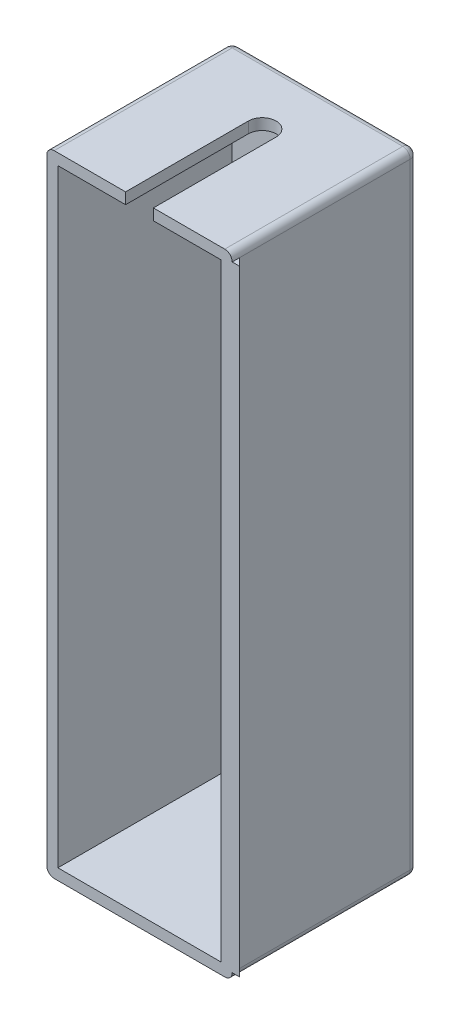
ISO-10303-21;
HEADER;
FILE_DESCRIPTION(('STEP AP214'),'2;1');
FILE_NAME('part.step','',(''),(''),'','','');
FILE_SCHEMA(('AUTOMOTIVE_DESIGN { 1 0 10303 214 1 1 1 1 }'));
ENDSEC;
DATA;
#1=APPLICATION_CONTEXT('core data for automotive mechanical design processes');
#2=APPLICATION_PROTOCOL_DEFINITION('international standard','automotive_design',2000,#1);
#3=PRODUCT_CONTEXT('',#1,'mechanical');
#4=PRODUCT('Part','Part','',(#3));
#5=PRODUCT_RELATED_PRODUCT_CATEGORY('part','',(#4));
#6=PRODUCT_DEFINITION_FORMATION('','',#4);
#7=PRODUCT_DEFINITION_CONTEXT('part definition',#1,'design');
#8=PRODUCT_DEFINITION('design','',#6,#7);
#9=PRODUCT_DEFINITION_SHAPE('','',#8);
#10=(LENGTH_UNIT() NAMED_UNIT(*) SI_UNIT(.MILLI.,.METRE.));
#11=(NAMED_UNIT(*) PLANE_ANGLE_UNIT() SI_UNIT($,.RADIAN.));
#12=(NAMED_UNIT(*) SI_UNIT($,.STERADIAN.) SOLID_ANGLE_UNIT());
#13=UNCERTAINTY_MEASURE_WITH_UNIT(LENGTH_MEASURE(1.E-05),#10,'distance_accuracy_value','');
#14=(GEOMETRIC_REPRESENTATION_CONTEXT(3) GLOBAL_UNCERTAINTY_ASSIGNED_CONTEXT((#13)) GLOBAL_UNIT_ASSIGNED_CONTEXT((#10,
#11,#12)) REPRESENTATION_CONTEXT('',''));
#15=CARTESIAN_POINT('',(0.,0.,0.));
#16=DIRECTION('',(0.,0.,1.));
#17=DIRECTION('',(1.,0.,0.));
#18=AXIS2_PLACEMENT_3D('',#15,#16,#17);
#19=CARTESIAN_POINT('',(25.,85.,50.));
#20=DIRECTION('',(-1.,0.,0.));
#21=DIRECTION('',(0.,-1.,0.));
#22=AXIS2_PLACEMENT_3D('',#19,#20,#21);
#23=PLANE('',#22);
#24=DIRECTION('',(0.,1.,0.));
#25=VECTOR('',#24,1.);
#26=CARTESIAN_POINT('',(25.,83.,48.));
#27=LINE('',#26,#25);
#28=CARTESIAN_POINT('',(25.,-83.,48.));
#29=VERTEX_POINT('',#28);
#30=CARTESIAN_POINT('',(25.,83.,48.));
#31=VERTEX_POINT('',#30);
#32=EDGE_CURVE('E211',#29,#31,#27,.T.);
#33=ORIENTED_EDGE('',*,*,#32,.F.);
#34=DIRECTION('',(0.,0.,-1.));
#35=VECTOR('',#34,1.);
#36=CARTESIAN_POINT('',(25.,-83.,50.));
#37=LINE('',#36,#35);
#38=CARTESIAN_POINT('',(25.,-83.,2.));
#39=VERTEX_POINT('',#38);
#40=EDGE_CURVE('E274',#29,#39,#37,.T.);
#41=ORIENTED_EDGE('',*,*,#40,.T.);
#42=DIRECTION('',(0.,1.,0.));
#43=VECTOR('',#42,1.);
#44=CARTESIAN_POINT('',(25.,85.,2.));
#45=LINE('',#44,#43);
#46=CARTESIAN_POINT('',(25.,83.,2.));
#47=VERTEX_POINT('',#46);
#48=EDGE_CURVE('E272',#39,#47,#45,.T.);
#49=ORIENTED_EDGE('',*,*,#48,.T.);
#50=DIRECTION('',(0.,0.,-1.));
#51=VECTOR('',#50,1.);
#52=CARTESIAN_POINT('',(25.,83.,50.));
#53=LINE('',#52,#51);
#54=EDGE_CURVE('E269',#47,#31,#53,.F.);
#55=ORIENTED_EDGE('',*,*,#54,.T.);
#56=EDGE_LOOP('',(#33,#41,#49,#55));
#57=FACE_BOUND('',#56,.T.);
#58=ADVANCED_FACE('F41',(#57),#23,.F.);
#59=CARTESIAN_POINT('',(-25.,85.,50.));
#60=DIRECTION('',(1.,0.,0.));
#61=DIRECTION('',(0.,1.,0.));
#62=AXIS2_PLACEMENT_3D('',#59,#60,#61);
#63=PLANE('',#62);
#64=DIRECTION('',(0.,-1.,0.));
#65=VECTOR('',#64,1.);
#66=CARTESIAN_POINT('',(-25.,-85.,2.));
#67=LINE('',#66,#65);
#68=CARTESIAN_POINT('',(-25.,83.,2.));
#69=VERTEX_POINT('',#68);
#70=CARTESIAN_POINT('',(-25.,-83.,2.));
#71=VERTEX_POINT('',#70);
#72=EDGE_CURVE('E303',#69,#71,#67,.T.);
#73=ORIENTED_EDGE('',*,*,#72,.T.);
#74=DIRECTION('',(0.,0.,-1.));
#75=VECTOR('',#74,1.);
#76=CARTESIAN_POINT('',(-25.,-83.,50.));
#77=LINE('',#76,#75);
#78=CARTESIAN_POINT('',(-25.,-83.,50.));
#79=VERTEX_POINT('',#78);
#80=EDGE_CURVE('E305',#71,#79,#77,.F.);
#81=ORIENTED_EDGE('',*,*,#80,.T.);
#82=DIRECTION('',(0.,-1.,0.));
#83=VECTOR('',#82,1.);
#84=CARTESIAN_POINT('',(-25.,85.,50.));
#85=LINE('',#84,#83);
#86=CARTESIAN_POINT('',(-25.,83.,50.));
#87=VERTEX_POINT('',#86);
#88=EDGE_CURVE('E254',#87,#79,#85,.T.);
#89=ORIENTED_EDGE('',*,*,#88,.F.);
#90=DIRECTION('',(0.,0.,-1.));
#91=VECTOR('',#90,1.);
#92=CARTESIAN_POINT('',(-25.,83.,50.));
#93=LINE('',#92,#91);
#94=EDGE_CURVE('E301',#87,#69,#93,.T.);
#95=ORIENTED_EDGE('',*,*,#94,.T.);
#96=EDGE_LOOP('',(#73,#81,#89,#95));
#97=FACE_BOUND('',#96,.T.);
#98=ADVANCED_FACE('F410',(#97),#63,.F.);
#99=CARTESIAN_POINT('',(25.,-85.,50.));
#100=DIRECTION('',(0.,1.,0.));
#101=DIRECTION('',(0.,0.,1.));
#102=AXIS2_PLACEMENT_3D('',#99,#100,#101);
#103=PLANE('',#102);
#104=DIRECTION('',(1.,0.,0.));
#105=VECTOR('',#104,1.);
#106=CARTESIAN_POINT('',(25.,-85.,2.));
#107=LINE('',#106,#105);
#108=CARTESIAN_POINT('',(-23.,-85.,2.));
#109=VERTEX_POINT('',#108);
#110=CARTESIAN_POINT('',(23.,-85.,2.));
#111=VERTEX_POINT('',#110);
#112=EDGE_CURVE('E280',#109,#111,#107,.T.);
#113=ORIENTED_EDGE('',*,*,#112,.T.);
#114=DIRECTION('',(0.,0.,-1.));
#115=VECTOR('',#114,1.);
#116=CARTESIAN_POINT('',(23.,-85.,50.));
#117=LINE('',#116,#115);
#118=CARTESIAN_POINT('',(23.,-85.,50.));
#119=VERTEX_POINT('',#118);
#120=EDGE_CURVE('E282',#111,#119,#117,.F.);
#121=ORIENTED_EDGE('',*,*,#120,.T.);
#122=DIRECTION('',(1.,0.,0.));
#123=VECTOR('',#122,1.);
#124=CARTESIAN_POINT('',(25.,-85.,50.));
#125=LINE('',#124,#123);
#126=CARTESIAN_POINT('',(-23.,-85.,50.));
#127=VERTEX_POINT('',#126);
#128=EDGE_CURVE('E263',#127,#119,#125,.T.);
#129=ORIENTED_EDGE('',*,*,#128,.F.);
#130=DIRECTION('',(0.,0.,-1.));
#131=VECTOR('',#130,1.);
#132=CARTESIAN_POINT('',(-23.,-85.,50.));
#133=LINE('',#132,#131);
#134=EDGE_CURVE('E278',#127,#109,#133,.T.);
#135=ORIENTED_EDGE('',*,*,#134,.T.);
#136=EDGE_LOOP('',(#113,#121,#129,#135));
#137=FACE_BOUND('',#136,.T.);
#138=ADVANCED_FACE('F420',(#137),#103,.F.);
#139=CARTESIAN_POINT('',(25.,85.,50.));
#140=DIRECTION('',(0.,-1.,0.));
#141=DIRECTION('',(0.,0.,-1.));
#142=AXIS2_PLACEMENT_3D('',#139,#140,#141);
#143=PLANE('',#142);
#144=CARTESIAN_POINT('',(0.,85.,16.8957688841481));
#145=DIRECTION('',(0.,1.,0.));
#146=DIRECTION('',(0.,0.,1.));
#147=AXIS2_PLACEMENT_3D('',#144,#145,#146);
#148=CIRCLE('',#147,3.75027902119465);
#149=CARTESIAN_POINT('',(3.75027902119465,85.,16.8957688841481));
#150=VERTEX_POINT('',#149);
#151=CARTESIAN_POINT('',(-3.75027902119465,85.,16.8957688841481));
#152=VERTEX_POINT('',#151);
#153=EDGE_CURVE('E188',#150,#152,#148,.T.);
#154=ORIENTED_EDGE('',*,*,#153,.F.);
#155=DIRECTION('',(0.,0.,-1.));
#156=VECTOR('',#155,1.);
#157=CARTESIAN_POINT('',(3.75027902119465,85.,16.8957688841481));
#158=LINE('',#157,#156);
#159=CARTESIAN_POINT('',(3.75027902119463,85.,50.));
#160=VERTEX_POINT('',#159);
#161=EDGE_CURVE('E185',#160,#150,#158,.T.);
#162=ORIENTED_EDGE('',*,*,#161,.F.);
#163=DIRECTION('',(-1.,0.,0.));
#164=VECTOR('',#163,1.);
#165=CARTESIAN_POINT('',(25.,85.,50.));
#166=LINE('',#165,#164);
#167=CARTESIAN_POINT('',(23.,85.,50.));
#168=VERTEX_POINT('',#167);
#169=EDGE_CURVE('E266',#168,#160,#166,.T.);
#170=ORIENTED_EDGE('',*,*,#169,.F.);
#171=DIRECTION('',(0.,0.,-1.));
#172=VECTOR('',#171,1.);
#173=CARTESIAN_POINT('',(23.,85.,50.));
#174=LINE('',#173,#172);
#175=CARTESIAN_POINT('',(23.,85.,2.));
#176=VERTEX_POINT('',#175);
#177=EDGE_CURVE('E64',#168,#176,#174,.T.);
#178=ORIENTED_EDGE('',*,*,#177,.T.);
#179=DIRECTION('',(-1.,0.,0.));
#180=VECTOR('',#179,1.);
#181=CARTESIAN_POINT('',(-25.,85.,2.));
#182=LINE('',#181,#180);
#183=CARTESIAN_POINT('',(-23.,85.,2.));
#184=VERTEX_POINT('',#183);
#185=EDGE_CURVE('E309',#176,#184,#182,.T.);
#186=ORIENTED_EDGE('',*,*,#185,.T.);
#187=DIRECTION('',(0.,0.,-1.));
#188=VECTOR('',#187,1.);
#189=CARTESIAN_POINT('',(-23.,85.,50.));
#190=LINE('',#189,#188);
#191=CARTESIAN_POINT('',(-23.,85.,50.));
#192=VERTEX_POINT('',#191);
#193=EDGE_CURVE('E307',#184,#192,#190,.F.);
#194=ORIENTED_EDGE('',*,*,#193,.T.);
#195=CARTESIAN_POINT('',(-3.75027902119467,85.,50.));
#196=VERTEX_POINT('',#195);
#197=EDGE_CURVE('E198',#196,#192,#166,.T.);
#198=ORIENTED_EDGE('',*,*,#197,.F.);
#199=DIRECTION('',(0.,0.,1.));
#200=VECTOR('',#199,1.);
#201=CARTESIAN_POINT('',(-3.75027902119465,85.,16.8957688841481));
#202=LINE('',#201,#200);
#203=EDGE_CURVE('E181',#152,#196,#202,.T.);
#204=ORIENTED_EDGE('',*,*,#203,.F.);
#205=EDGE_LOOP('',(#154,#162,#170,#178,#186,#194,#198,#204));
#206=FACE_BOUND('',#205,.T.);
#207=ADVANCED_FACE('F196',(#206),#143,.F.);
#208=CARTESIAN_POINT('',(0.,0.,50.));
#209=DIRECTION('',(0.,0.,-1.));
#210=DIRECTION('',(-1.,0.,0.));
#211=AXIS2_PLACEMENT_3D('',#208,#209,#210);
#212=PLANE('',#211);
#213=ORIENTED_EDGE('',*,*,#169,.T.);
#214=DIRECTION('',(0.,1.,0.));
#215=VECTOR('',#214,1.);
#216=CARTESIAN_POINT('',(3.75027902119463,75.,50.));
#217=LINE('',#216,#215);
#218=CARTESIAN_POINT('',(3.75027902119463,82.,50.));
#219=VERTEX_POINT('',#218);
#220=EDGE_CURVE('E204',#219,#160,#217,.T.);
#221=ORIENTED_EDGE('',*,*,#220,.F.);
#222=DIRECTION('',(-1.,0.,0.));
#223=VECTOR('',#222,1.);
#224=CARTESIAN_POINT('',(-22.,82.,50.));
#225=LINE('',#224,#223);
#226=CARTESIAN_POINT('',(22.,82.,50.));
#227=VERTEX_POINT('',#226);
#228=EDGE_CURVE('E229',#227,#219,#225,.T.);
#229=ORIENTED_EDGE('',*,*,#228,.F.);
#230=DIRECTION('',(0.,1.,0.));
#231=VECTOR('',#230,1.);
#232=CARTESIAN_POINT('',(22.,82.,50.));
#233=LINE('',#232,#231);
#234=CARTESIAN_POINT('',(22.,-82.,50.));
#235=VERTEX_POINT('',#234);
#236=EDGE_CURVE('E245',#235,#227,#233,.T.);
#237=ORIENTED_EDGE('',*,*,#236,.F.);
#238=DIRECTION('',(1.,0.,0.));
#239=VECTOR('',#238,1.);
#240=CARTESIAN_POINT('',(-22.,-82.,50.));
#241=LINE('',#240,#239);
#242=CARTESIAN_POINT('',(-22.,-82.,50.));
#243=VERTEX_POINT('',#242);
#244=EDGE_CURVE('E241',#243,#235,#241,.T.);
#245=ORIENTED_EDGE('',*,*,#244,.F.);
#246=DIRECTION('',(0.,-1.,0.));
#247=VECTOR('',#246,1.);
#248=CARTESIAN_POINT('',(-22.,82.,50.));
#249=LINE('',#248,#247);
#250=CARTESIAN_POINT('',(-22.,82.,50.));
#251=VERTEX_POINT('',#250);
#252=EDGE_CURVE('E239',#251,#243,#249,.T.);
#253=ORIENTED_EDGE('',*,*,#252,.F.);
#254=CARTESIAN_POINT('',(-3.75027902119466,82.,50.));
#255=VERTEX_POINT('',#254);
#256=EDGE_CURVE('E248',#255,#251,#225,.T.);
#257=ORIENTED_EDGE('',*,*,#256,.F.);
#258=DIRECTION('',(0.,1.,0.));
#259=VECTOR('',#258,1.);
#260=CARTESIAN_POINT('',(-3.75027902119467,75.,50.));
#261=LINE('',#260,#259);
#262=EDGE_CURVE('E56',#255,#196,#261,.T.);
#263=ORIENTED_EDGE('',*,*,#262,.T.);
#264=ORIENTED_EDGE('',*,*,#197,.T.);
#265=CARTESIAN_POINT('',(-23.,83.,50.));
#266=DIRECTION('',(0.,0.,-1.));
#267=DIRECTION('',(-1.,0.,0.));
#268=AXIS2_PLACEMENT_3D('',#265,#266,#267);
#269=CIRCLE('',#268,2.);
#270=EDGE_CURVE('E284',#192,#87,#269,.F.);
#271=ORIENTED_EDGE('',*,*,#270,.T.);
#272=ORIENTED_EDGE('',*,*,#88,.T.);
#273=CARTESIAN_POINT('',(-23.,-83.,50.));
#274=DIRECTION('',(0.,0.,-1.));
#275=DIRECTION('',(-1.,0.,0.));
#276=AXIS2_PLACEMENT_3D('',#273,#274,#275);
#277=CIRCLE('',#276,2.);
#278=EDGE_CURVE('E288',#79,#127,#277,.F.);
#279=ORIENTED_EDGE('',*,*,#278,.T.);
#280=ORIENTED_EDGE('',*,*,#128,.T.);
#281=CARTESIAN_POINT('',(23.,-83.,50.));
#282=DIRECTION('',(0.,0.,-1.));
#283=DIRECTION('',(-1.,0.,0.));
#284=AXIS2_PLACEMENT_3D('',#281,#282,#283);
#285=CIRCLE('',#284,2.);
#286=CARTESIAN_POINT('',(25.,-83.,50.));
#287=VERTEX_POINT('',#286);
#288=EDGE_CURVE('E290',#119,#287,#285,.F.);
#289=ORIENTED_EDGE('',*,*,#288,.T.);
#290=DIRECTION('',(-1.,0.,0.));
#291=VECTOR('',#290,1.);
#292=CARTESIAN_POINT('',(27.,-83.,50.));
#293=LINE('',#292,#291);
#294=CARTESIAN_POINT('',(27.,-83.,50.));
#295=VERTEX_POINT('',#294);
#296=EDGE_CURVE('E221',#295,#287,#293,.T.);
#297=ORIENTED_EDGE('',*,*,#296,.F.);
#298=DIRECTION('',(0.,-1.,0.));
#299=VECTOR('',#298,1.);
#300=CARTESIAN_POINT('',(27.,83.,50.));
#301=LINE('',#300,#299);
#302=CARTESIAN_POINT('',(27.,83.,50.));
#303=VERTEX_POINT('',#302);
#304=EDGE_CURVE('E212',#303,#295,#301,.T.);
#305=ORIENTED_EDGE('',*,*,#304,.F.);
#306=DIRECTION('',(-1.,0.,0.));
#307=VECTOR('',#306,1.);
#308=CARTESIAN_POINT('',(27.,83.,50.));
#309=LINE('',#308,#307);
#310=CARTESIAN_POINT('',(25.,83.,50.));
#311=VERTEX_POINT('',#310);
#312=EDGE_CURVE('E214',#303,#311,#309,.T.);
#313=ORIENTED_EDGE('',*,*,#312,.T.);
#314=CARTESIAN_POINT('',(23.,83.,50.));
#315=DIRECTION('',(0.,0.,-1.));
#316=DIRECTION('',(-1.,0.,0.));
#317=AXIS2_PLACEMENT_3D('',#314,#315,#316);
#318=CIRCLE('',#317,2.);
#319=EDGE_CURVE('E286',#311,#168,#318,.F.);
#320=ORIENTED_EDGE('',*,*,#319,.T.);
#321=EDGE_LOOP('',(#213,#221,#229,#237,#245,#253,#257,#263,#264,#271,#272,#279,#280,#289,#297,
#305,#313,#320));
#322=FACE_BOUND('',#321,.T.);
#323=ADVANCED_FACE('F352',(#322),#212,.F.);
#324=CARTESIAN_POINT('',(0.,0.,0.));
#325=DIRECTION('',(0.,0.,-1.));
#326=DIRECTION('',(-1.,0.,0.));
#327=AXIS2_PLACEMENT_3D('',#324,#325,#326);
#328=PLANE('',#327);
#329=DIRECTION('',(-1.,0.,0.));
#330=VECTOR('',#329,1.);
#331=CARTESIAN_POINT('',(25.,83.,0.));
#332=LINE('',#331,#330);
#333=CARTESIAN_POINT('',(-23.,83.,0.));
#334=VERTEX_POINT('',#333);
#335=CARTESIAN_POINT('',(23.,83.,0.));
#336=VERTEX_POINT('',#335);
#337=EDGE_CURVE('E292',#334,#336,#332,.F.);
#338=ORIENTED_EDGE('',*,*,#337,.T.);
#339=DIRECTION('',(0.,1.,0.));
#340=VECTOR('',#339,1.);
#341=CARTESIAN_POINT('',(23.,-85.,0.));
#342=LINE('',#341,#340);
#343=CARTESIAN_POINT('',(23.,-83.,0.));
#344=VERTEX_POINT('',#343);
#345=EDGE_CURVE('E298',#336,#344,#342,.F.);
#346=ORIENTED_EDGE('',*,*,#345,.T.);
#347=DIRECTION('',(1.,0.,0.));
#348=VECTOR('',#347,1.);
#349=CARTESIAN_POINT('',(-25.,-83.,0.));
#350=LINE('',#349,#348);
#351=CARTESIAN_POINT('',(-23.,-83.,0.));
#352=VERTEX_POINT('',#351);
#353=EDGE_CURVE('E296',#344,#352,#350,.F.);
#354=ORIENTED_EDGE('',*,*,#353,.T.);
#355=DIRECTION('',(0.,-1.,0.));
#356=VECTOR('',#355,1.);
#357=CARTESIAN_POINT('',(-23.,85.,0.));
#358=LINE('',#357,#356);
#359=EDGE_CURVE('E294',#352,#334,#358,.F.);
#360=ORIENTED_EDGE('',*,*,#359,.T.);
#361=EDGE_LOOP('',(#338,#346,#354,#360));
#362=FACE_BOUND('',#361,.T.);
#363=ADVANCED_FACE('F425',(#362),#328,.T.);
#364=CARTESIAN_POINT('',(-22.,82.,3.));
#365=DIRECTION('',(-1.,0.,0.));
#366=DIRECTION('',(0.,-1.,0.));
#367=AXIS2_PLACEMENT_3D('',#364,#365,#366);
#368=PLANE('',#367);
#369=ORIENTED_EDGE('',*,*,#252,.T.);
#370=DIRECTION('',(0.,0.,1.));
#371=VECTOR('',#370,1.);
#372=CARTESIAN_POINT('',(-22.,-82.,3.));
#373=LINE('',#372,#371);
#374=CARTESIAN_POINT('',(-22.,-82.,3.));
#375=VERTEX_POINT('',#374);
#376=EDGE_CURVE('E238',#375,#243,#373,.T.);
#377=ORIENTED_EDGE('',*,*,#376,.F.);
#378=DIRECTION('',(0.,-1.,0.));
#379=VECTOR('',#378,1.);
#380=CARTESIAN_POINT('',(-22.,82.,3.));
#381=LINE('',#380,#379);
#382=CARTESIAN_POINT('',(-22.,82.,3.));
#383=VERTEX_POINT('',#382);
#384=EDGE_CURVE('E225',#383,#375,#381,.T.);
#385=ORIENTED_EDGE('',*,*,#384,.F.);
#386=DIRECTION('',(0.,0.,1.));
#387=VECTOR('',#386,1.);
#388=CARTESIAN_POINT('',(-22.,82.,3.));
#389=LINE('',#388,#387);
#390=EDGE_CURVE('E251',#383,#251,#389,.T.);
#391=ORIENTED_EDGE('',*,*,#390,.T.);
#392=EDGE_LOOP('',(#369,#377,#385,#391));
#393=FACE_BOUND('',#392,.T.);
#394=ADVANCED_FACE('F671',(#393),#368,.F.);
#395=CARTESIAN_POINT('',(-22.,82.,3.));
#396=DIRECTION('',(0.,1.,0.));
#397=DIRECTION('',(0.,0.,1.));
#398=AXIS2_PLACEMENT_3D('',#395,#396,#397);
#399=PLANE('',#398);
#400=ORIENTED_EDGE('',*,*,#228,.T.);
#401=DIRECTION('',(0.,0.,-1.));
#402=VECTOR('',#401,1.);
#403=CARTESIAN_POINT('',(3.75027902119466,82.,3.00000000000002));
#404=LINE('',#403,#402);
#405=CARTESIAN_POINT('',(3.75027902119465,82.,16.8957688841481));
#406=VERTEX_POINT('',#405);
#407=EDGE_CURVE('E11',#219,#406,#404,.T.);
#408=ORIENTED_EDGE('',*,*,#407,.T.);
#409=CARTESIAN_POINT('',(0.,82.,16.8957688841481));
#410=DIRECTION('',(0.,1.,0.));
#411=DIRECTION('',(0.,0.,1.));
#412=AXIS2_PLACEMENT_3D('',#409,#410,#411);
#413=CIRCLE('',#412,3.75027902119465);
#414=CARTESIAN_POINT('',(-3.75027902119465,82.,16.8957688841481));
#415=VERTEX_POINT('',#414);
#416=EDGE_CURVE('E49',#406,#415,#413,.T.);
#417=ORIENTED_EDGE('',*,*,#416,.T.);
#418=DIRECTION('',(0.,0.,1.));
#419=VECTOR('',#418,1.);
#420=CARTESIAN_POINT('',(-3.75027902119463,82.,3.00000000000001));
#421=LINE('',#420,#419);
#422=EDGE_CURVE('E182',#415,#255,#421,.T.);
#423=ORIENTED_EDGE('',*,*,#422,.T.);
#424=ORIENTED_EDGE('',*,*,#256,.T.);
#425=ORIENTED_EDGE('',*,*,#390,.F.);
#426=DIRECTION('',(-1.,0.,0.));
#427=VECTOR('',#426,1.);
#428=CARTESIAN_POINT('',(-22.,82.,3.));
#429=LINE('',#428,#427);
#430=CARTESIAN_POINT('',(22.,82.,3.));
#431=VERTEX_POINT('',#430);
#432=EDGE_CURVE('E235',#431,#383,#429,.T.);
#433=ORIENTED_EDGE('',*,*,#432,.F.);
#434=DIRECTION('',(0.,0.,1.));
#435=VECTOR('',#434,1.);
#436=CARTESIAN_POINT('',(22.,82.,3.));
#437=LINE('',#436,#435);
#438=EDGE_CURVE('E255',#431,#227,#437,.T.);
#439=ORIENTED_EDGE('',*,*,#438,.T.);
#440=EDGE_LOOP('',(#400,#408,#417,#423,#424,#425,#433,#439));
#441=FACE_BOUND('',#440,.T.);
#442=ADVANCED_FACE('F346',(#441),#399,.F.);
#443=CARTESIAN_POINT('',(22.,82.,3.));
#444=DIRECTION('',(1.,0.,0.));
#445=DIRECTION('',(0.,1.,0.));
#446=AXIS2_PLACEMENT_3D('',#443,#444,#445);
#447=PLANE('',#446);
#448=ORIENTED_EDGE('',*,*,#236,.T.);
#449=ORIENTED_EDGE('',*,*,#438,.F.);
#450=DIRECTION('',(0.,1.,0.));
#451=VECTOR('',#450,1.);
#452=CARTESIAN_POINT('',(22.,82.,3.));
#453=LINE('',#452,#451);
#454=CARTESIAN_POINT('',(22.,-82.,3.));
#455=VERTEX_POINT('',#454);
#456=EDGE_CURVE('E232',#455,#431,#453,.T.);
#457=ORIENTED_EDGE('',*,*,#456,.F.);
#458=DIRECTION('',(0.,0.,1.));
#459=VECTOR('',#458,1.);
#460=CARTESIAN_POINT('',(22.,-82.,3.));
#461=LINE('',#460,#459);
#462=EDGE_CURVE('E257',#455,#235,#461,.T.);
#463=ORIENTED_EDGE('',*,*,#462,.T.);
#464=EDGE_LOOP('',(#448,#449,#457,#463));
#465=FACE_BOUND('',#464,.T.);
#466=ADVANCED_FACE('F650',(#465),#447,.F.);
#467=CARTESIAN_POINT('',(-22.,-82.,3.));
#468=DIRECTION('',(0.,-1.,0.));
#469=DIRECTION('',(0.,0.,-1.));
#470=AXIS2_PLACEMENT_3D('',#467,#468,#469);
#471=PLANE('',#470);
#472=ORIENTED_EDGE('',*,*,#244,.T.);
#473=ORIENTED_EDGE('',*,*,#462,.F.);
#474=DIRECTION('',(1.,0.,0.));
#475=VECTOR('',#474,1.);
#476=CARTESIAN_POINT('',(-22.,-82.,3.));
#477=LINE('',#476,#475);
#478=EDGE_CURVE('E228',#375,#455,#477,.T.);
#479=ORIENTED_EDGE('',*,*,#478,.F.);
#480=ORIENTED_EDGE('',*,*,#376,.T.);
#481=EDGE_LOOP('',(#472,#473,#479,#480));
#482=FACE_BOUND('',#481,.T.);
#483=ADVANCED_FACE('F638',(#482),#471,.F.);
#484=CARTESIAN_POINT('',(0.,0.,3.));
#485=DIRECTION('',(0.,0.,1.));
#486=DIRECTION('',(1.,0.,0.));
#487=AXIS2_PLACEMENT_3D('',#484,#485,#486);
#488=PLANE('',#487);
#489=ORIENTED_EDGE('',*,*,#384,.T.);
#490=ORIENTED_EDGE('',*,*,#478,.T.);
#491=ORIENTED_EDGE('',*,*,#456,.T.);
#492=ORIENTED_EDGE('',*,*,#432,.T.);
#493=EDGE_LOOP('',(#489,#490,#491,#492));
#494=FACE_BOUND('',#493,.T.);
#495=ADVANCED_FACE('F628',(#494),#488,.T.);
#496=CARTESIAN_POINT('',(-23.,83.,50.));
#497=DIRECTION('',(0.,0.,-1.));
#498=DIRECTION('',(-1.,0.,0.));
#499=AXIS2_PLACEMENT_3D('',#496,#497,#498);
#500=CYLINDRICAL_SURFACE('',#499,2.);
#501=CARTESIAN_POINT('',(-23.,83.,2.));
#502=DIRECTION('',(0.,0.,-1.));
#503=DIRECTION('',(-1.,0.,0.));
#504=AXIS2_PLACEMENT_3D('',#501,#502,#503);
#505=CIRCLE('',#504,2.);
#506=EDGE_CURVE('E242',#69,#184,#505,.T.);
#507=ORIENTED_EDGE('',*,*,#506,.F.);
#508=ORIENTED_EDGE('',*,*,#94,.F.);
#509=ORIENTED_EDGE('',*,*,#270,.F.);
#510=ORIENTED_EDGE('',*,*,#193,.F.);
#511=EDGE_LOOP('',(#507,#508,#509,#510));
#512=FACE_BOUND('',#511,.T.);
#513=ADVANCED_FACE('F43',(#512),#500,.T.);
#514=CARTESIAN_POINT('',(-23.,83.,2.));
#515=DIRECTION('',(0.,1.,0.));
#516=DIRECTION('',(0.,0.,1.));
#517=AXIS2_PLACEMENT_3D('',#514,#515,#516);
#518=SPHERICAL_SURFACE('',#517,2.);
#519=CARTESIAN_POINT('',(-23.,83.,2.));
#520=DIRECTION('',(0.,1.,0.));
#521=DIRECTION('',(0.,0.,1.));
#522=AXIS2_PLACEMENT_3D('',#519,#520,#521);
#523=CIRCLE('',#522,2.);
#524=EDGE_CURVE('E337',#69,#334,#523,.F.);
#525=ORIENTED_EDGE('',*,*,#524,.F.);
#526=ORIENTED_EDGE('',*,*,#506,.T.);
#527=CARTESIAN_POINT('',(-23.,83.,2.));
#528=DIRECTION('',(-1.,0.,0.));
#529=DIRECTION('',(0.,0.,1.));
#530=AXIS2_PLACEMENT_3D('',#527,#528,#529);
#531=CIRCLE('',#530,2.);
#532=EDGE_CURVE('E340',#334,#184,#531,.F.);
#533=ORIENTED_EDGE('',*,*,#532,.F.);
#534=EDGE_LOOP('',(#525,#526,#533));
#535=FACE_BOUND('',#534,.T.);
#536=ADVANCED_FACE('F402',(#535),#518,.T.);
#537=CARTESIAN_POINT('',(23.,83.,50.));
#538=DIRECTION('',(0.,0.,-1.));
#539=DIRECTION('',(-1.,0.,0.));
#540=AXIS2_PLACEMENT_3D('',#537,#538,#539);
#541=CYLINDRICAL_SURFACE('',#540,2.);
#542=ORIENTED_EDGE('',*,*,#319,.F.);
#543=DIRECTION('',(0.,0.,1.));
#544=VECTOR('',#543,1.);
#545=CARTESIAN_POINT('',(25.,83.,50.));
#546=LINE('',#545,#544);
#547=EDGE_CURVE('E215',#31,#311,#546,.T.);
#548=ORIENTED_EDGE('',*,*,#547,.F.);
#549=ORIENTED_EDGE('',*,*,#54,.F.);
#550=CARTESIAN_POINT('',(23.,83.,2.));
#551=DIRECTION('',(0.,0.,-1.));
#552=DIRECTION('',(-1.,0.,0.));
#553=AXIS2_PLACEMENT_3D('',#550,#551,#552);
#554=CIRCLE('',#553,2.);
#555=EDGE_CURVE('E334',#176,#47,#554,.T.);
#556=ORIENTED_EDGE('',*,*,#555,.F.);
#557=ORIENTED_EDGE('',*,*,#177,.F.);
#558=EDGE_LOOP('',(#542,#548,#549,#556,#557));
#559=FACE_BOUND('',#558,.T.);
#560=ADVANCED_FACE('F358',(#559),#541,.T.);
#561=CARTESIAN_POINT('',(25.,83.,2.));
#562=DIRECTION('',(1.,0.,0.));
#563=DIRECTION('',(0.,0.,-1.));
#564=AXIS2_PLACEMENT_3D('',#561,#562,#563);
#565=CYLINDRICAL_SURFACE('',#564,2.);
#566=ORIENTED_EDGE('',*,*,#532,.T.);
#567=ORIENTED_EDGE('',*,*,#185,.F.);
#568=CARTESIAN_POINT('',(23.,83.,2.));
#569=DIRECTION('',(1.,0.,0.));
#570=DIRECTION('',(0.,0.,-1.));
#571=AXIS2_PLACEMENT_3D('',#568,#569,#570);
#572=CIRCLE('',#571,2.);
#573=EDGE_CURVE('E331',#336,#176,#572,.T.);
#574=ORIENTED_EDGE('',*,*,#573,.F.);
#575=ORIENTED_EDGE('',*,*,#337,.F.);
#576=EDGE_LOOP('',(#566,#567,#574,#575));
#577=FACE_BOUND('',#576,.T.);
#578=ADVANCED_FACE('F393',(#577),#565,.T.);
#579=CARTESIAN_POINT('',(-23.,85.,2.));
#580=DIRECTION('',(0.,1.,0.));
#581=DIRECTION('',(-1.,0.,0.));
#582=AXIS2_PLACEMENT_3D('',#579,#580,#581);
#583=CYLINDRICAL_SURFACE('',#582,2.);
#584=ORIENTED_EDGE('',*,*,#524,.T.);
#585=ORIENTED_EDGE('',*,*,#359,.F.);
#586=CARTESIAN_POINT('',(-23.,-83.,2.));
#587=DIRECTION('',(0.,-1.,0.));
#588=DIRECTION('',(0.,0.,-1.));
#589=AXIS2_PLACEMENT_3D('',#586,#587,#588);
#590=CIRCLE('',#589,2.);
#591=EDGE_CURVE('E328',#71,#352,#590,.T.);
#592=ORIENTED_EDGE('',*,*,#591,.F.);
#593=ORIENTED_EDGE('',*,*,#72,.F.);
#594=EDGE_LOOP('',(#584,#585,#592,#593));
#595=FACE_BOUND('',#594,.T.);
#596=ADVANCED_FACE('F407',(#595),#583,.T.);
#597=CARTESIAN_POINT('',(-23.,-83.,50.));
#598=DIRECTION('',(0.,0.,-1.));
#599=DIRECTION('',(-1.,0.,0.));
#600=AXIS2_PLACEMENT_3D('',#597,#598,#599);
#601=CYLINDRICAL_SURFACE('',#600,2.);
#602=ORIENTED_EDGE('',*,*,#278,.F.);
#603=ORIENTED_EDGE('',*,*,#80,.F.);
#604=CARTESIAN_POINT('',(-23.,-83.,2.));
#605=DIRECTION('',(0.,0.,-1.));
#606=DIRECTION('',(-1.,0.,0.));
#607=AXIS2_PLACEMENT_3D('',#604,#605,#606);
#608=CIRCLE('',#607,2.);
#609=EDGE_CURVE('E325',#109,#71,#608,.T.);
#610=ORIENTED_EDGE('',*,*,#609,.F.);
#611=ORIENTED_EDGE('',*,*,#134,.F.);
#612=EDGE_LOOP('',(#602,#603,#610,#611));
#613=FACE_BOUND('',#612,.T.);
#614=ADVANCED_FACE('F415',(#613),#601,.T.);
#615=CARTESIAN_POINT('',(23.,83.,2.));
#616=DIRECTION('',(0.,1.,0.));
#617=DIRECTION('',(0.,0.,1.));
#618=AXIS2_PLACEMENT_3D('',#615,#616,#617);
#619=SPHERICAL_SURFACE('',#618,2.);
#620=ORIENTED_EDGE('',*,*,#573,.T.);
#621=ORIENTED_EDGE('',*,*,#555,.T.);
#622=CARTESIAN_POINT('',(23.,83.,2.));
#623=DIRECTION('',(0.,1.,0.));
#624=DIRECTION('',(0.,0.,1.));
#625=AXIS2_PLACEMENT_3D('',#622,#623,#624);
#626=CIRCLE('',#625,2.);
#627=EDGE_CURVE('E322',#336,#47,#626,.F.);
#628=ORIENTED_EDGE('',*,*,#627,.F.);
#629=EDGE_LOOP('',(#620,#621,#628));
#630=FACE_BOUND('',#629,.T.);
#631=ADVANCED_FACE('F389',(#630),#619,.T.);
#632=CARTESIAN_POINT('',(-23.,-83.,2.));
#633=DIRECTION('',(-1.,0.,0.));
#634=DIRECTION('',(0.,0.,1.));
#635=AXIS2_PLACEMENT_3D('',#632,#633,#634);
#636=SPHERICAL_SURFACE('',#635,2.);
#637=ORIENTED_EDGE('',*,*,#609,.T.);
#638=ORIENTED_EDGE('',*,*,#591,.T.);
#639=CARTESIAN_POINT('',(-23.,-83.,2.));
#640=DIRECTION('',(-1.,0.,0.));
#641=DIRECTION('',(0.,-1.,0.));
#642=AXIS2_PLACEMENT_3D('',#639,#640,#641);
#643=CIRCLE('',#642,2.);
#644=EDGE_CURVE('E319',#109,#352,#643,.F.);
#645=ORIENTED_EDGE('',*,*,#644,.F.);
#646=EDGE_LOOP('',(#637,#638,#645));
#647=FACE_BOUND('',#646,.T.);
#648=ADVANCED_FACE('F427',(#647),#636,.T.);
#649=CARTESIAN_POINT('',(23.,85.,2.));
#650=DIRECTION('',(0.,-1.,0.));
#651=DIRECTION('',(1.,0.,0.));
#652=AXIS2_PLACEMENT_3D('',#649,#650,#651);
#653=CYLINDRICAL_SURFACE('',#652,2.);
#654=ORIENTED_EDGE('',*,*,#627,.T.);
#655=ORIENTED_EDGE('',*,*,#48,.F.);
#656=CARTESIAN_POINT('',(23.,-83.,2.));
#657=DIRECTION('',(0.,-1.,0.));
#658=DIRECTION('',(1.,0.,0.));
#659=AXIS2_PLACEMENT_3D('',#656,#657,#658);
#660=CIRCLE('',#659,2.);
#661=EDGE_CURVE('E316',#344,#39,#660,.T.);
#662=ORIENTED_EDGE('',*,*,#661,.F.);
#663=ORIENTED_EDGE('',*,*,#345,.F.);
#664=EDGE_LOOP('',(#654,#655,#662,#663));
#665=FACE_BOUND('',#664,.T.);
#666=ADVANCED_FACE('F386',(#665),#653,.T.);
#667=CARTESIAN_POINT('',(25.,-83.,2.));
#668=DIRECTION('',(-1.,0.,0.));
#669=DIRECTION('',(0.,0.,1.));
#670=AXIS2_PLACEMENT_3D('',#667,#668,#669);
#671=CYLINDRICAL_SURFACE('',#670,2.);
#672=ORIENTED_EDGE('',*,*,#644,.T.);
#673=ORIENTED_EDGE('',*,*,#353,.F.);
#674=CARTESIAN_POINT('',(23.,-83.,2.));
#675=DIRECTION('',(1.,0.,0.));
#676=DIRECTION('',(0.,0.,-1.));
#677=AXIS2_PLACEMENT_3D('',#674,#675,#676);
#678=CIRCLE('',#677,2.);
#679=EDGE_CURVE('E314',#111,#344,#678,.T.);
#680=ORIENTED_EDGE('',*,*,#679,.F.);
#681=ORIENTED_EDGE('',*,*,#112,.F.);
#682=EDGE_LOOP('',(#672,#673,#680,#681));
#683=FACE_BOUND('',#682,.T.);
#684=ADVANCED_FACE('F423',(#683),#671,.T.);
#685=CARTESIAN_POINT('',(23.,-83.,2.));
#686=DIRECTION('',(0.,0.,-1.));
#687=DIRECTION('',(-1.,0.,0.));
#688=AXIS2_PLACEMENT_3D('',#685,#686,#687);
#689=SPHERICAL_SURFACE('',#688,2.);
#690=ORIENTED_EDGE('',*,*,#679,.T.);
#691=ORIENTED_EDGE('',*,*,#661,.T.);
#692=CARTESIAN_POINT('',(23.,-83.,2.));
#693=DIRECTION('',(0.,0.,-1.));
#694=DIRECTION('',(-1.,0.,0.));
#695=AXIS2_PLACEMENT_3D('',#692,#693,#694);
#696=CIRCLE('',#695,2.);
#697=EDGE_CURVE('E224',#111,#39,#696,.F.);
#698=ORIENTED_EDGE('',*,*,#697,.F.);
#699=EDGE_LOOP('',(#690,#691,#698));
#700=FACE_BOUND('',#699,.T.);
#701=ADVANCED_FACE('F381',(#700),#689,.T.);
#702=CARTESIAN_POINT('',(23.,-83.,50.));
#703=DIRECTION('',(0.,0.,-1.));
#704=DIRECTION('',(-1.,0.,0.));
#705=AXIS2_PLACEMENT_3D('',#702,#703,#704);
#706=CYLINDRICAL_SURFACE('',#705,2.);
#707=ORIENTED_EDGE('',*,*,#288,.F.);
#708=ORIENTED_EDGE('',*,*,#120,.F.);
#709=ORIENTED_EDGE('',*,*,#697,.T.);
#710=ORIENTED_EDGE('',*,*,#40,.F.);
#711=EDGE_CURVE('E275',#287,#29,#37,.T.);
#712=ORIENTED_EDGE('',*,*,#711,.F.);
#713=EDGE_LOOP('',(#707,#708,#709,#710,#712));
#714=FACE_BOUND('',#713,.T.);
#715=ADVANCED_FACE('F375',(#714),#706,.T.);
#716=CARTESIAN_POINT('',(27.,-83.,50.));
#717=DIRECTION('',(0.,1.,0.));
#718=DIRECTION('',(-1.,0.,0.));
#719=AXIS2_PLACEMENT_3D('',#716,#717,#718);
#720=PLANE('',#719);
#721=ORIENTED_EDGE('',*,*,#711,.T.);
#722=DIRECTION('',(-0.707106781186546,0.,-0.707106781186549));
#723=VECTOR('',#722,1.);
#724=CARTESIAN_POINT('',(25.,-83.,48.));
#725=LINE('',#724,#723);
#726=EDGE_CURVE('E203',#295,#29,#725,.T.);
#727=ORIENTED_EDGE('',*,*,#726,.F.);
#728=ORIENTED_EDGE('',*,*,#296,.T.);
#729=EDGE_LOOP('',(#721,#727,#728));
#730=FACE_BOUND('',#729,.T.);
#731=ADVANCED_FACE('F371',(#730),#720,.F.);
#732=CARTESIAN_POINT('',(27.,83.,50.));
#733=DIRECTION('',(0.,-1.,0.));
#734=DIRECTION('',(1.,0.,0.));
#735=AXIS2_PLACEMENT_3D('',#732,#733,#734);
#736=PLANE('',#735);
#737=ORIENTED_EDGE('',*,*,#312,.F.);
#738=DIRECTION('',(-0.707106781186546,0.,-0.707106781186549));
#739=VECTOR('',#738,1.);
#740=CARTESIAN_POINT('',(27.,83.,50.));
#741=LINE('',#740,#739);
#742=EDGE_CURVE('E208',#303,#31,#741,.T.);
#743=ORIENTED_EDGE('',*,*,#742,.T.);
#744=ORIENTED_EDGE('',*,*,#547,.T.);
#745=EDGE_LOOP('',(#737,#743,#744));
#746=FACE_BOUND('',#745,.T.);
#747=ADVANCED_FACE('F362',(#746),#736,.F.);
#748=CARTESIAN_POINT('',(25.,87.,48.));
#749=DIRECTION('',(-0.707106781186549,0.,0.707106781186546));
#750=DIRECTION('',(0.707106781186546,0.,0.707106781186549));
#751=AXIS2_PLACEMENT_3D('',#748,#749,#750);
#752=PLANE('',#751);
#753=ORIENTED_EDGE('',*,*,#304,.T.);
#754=ORIENTED_EDGE('',*,*,#726,.T.);
#755=ORIENTED_EDGE('',*,*,#32,.T.);
#756=ORIENTED_EDGE('',*,*,#742,.F.);
#757=EDGE_LOOP('',(#753,#754,#755,#756));
#758=FACE_BOUND('',#757,.T.);
#759=ADVANCED_FACE('F364',(#758),#752,.F.);
#760=CARTESIAN_POINT('',(0.,75.,16.8957688841481));
#761=DIRECTION('',(0.,1.,0.));
#762=DIRECTION('',(0.,0.,1.));
#763=AXIS2_PLACEMENT_3D('',#760,#761,#762);
#764=CYLINDRICAL_SURFACE('',#763,3.75027902119465);
#765=DIRECTION('',(0.,1.,0.));
#766=VECTOR('',#765,1.);
#767=CARTESIAN_POINT('',(3.75027902119465,75.,16.8957688841481));
#768=LINE('',#767,#766);
#769=EDGE_CURVE('E191',#406,#150,#768,.T.);
#770=ORIENTED_EDGE('',*,*,#769,.T.);
#771=ORIENTED_EDGE('',*,*,#153,.T.);
#772=DIRECTION('',(0.,1.,0.));
#773=VECTOR('',#772,1.);
#774=CARTESIAN_POINT('',(-3.75027902119465,75.,16.8957688841481));
#775=LINE('',#774,#773);
#776=EDGE_CURVE('E177',#415,#152,#775,.T.);
#777=ORIENTED_EDGE('',*,*,#776,.F.);
#778=ORIENTED_EDGE('',*,*,#416,.F.);
#779=EDGE_LOOP('',(#770,#771,#777,#778));
#780=FACE_BOUND('',#779,.T.);
#781=ADVANCED_FACE('F189',(#780),#764,.F.);
#782=CARTESIAN_POINT('',(3.75027902119465,75.,16.8957688841481));
#783=DIRECTION('',(1.,0.,0.));
#784=DIRECTION('',(0.,0.,-1.));
#785=AXIS2_PLACEMENT_3D('',#782,#783,#784);
#786=PLANE('',#785);
#787=ORIENTED_EDGE('',*,*,#220,.T.);
#788=ORIENTED_EDGE('',*,*,#161,.T.);
#789=ORIENTED_EDGE('',*,*,#769,.F.);
#790=ORIENTED_EDGE('',*,*,#407,.F.);
#791=EDGE_LOOP('',(#787,#788,#789,#790));
#792=FACE_BOUND('',#791,.T.);
#793=ADVANCED_FACE('F349',(#792),#786,.F.);
#794=CARTESIAN_POINT('',(-3.75027902119465,75.,16.8957688841481));
#795=DIRECTION('',(-1.,0.,0.));
#796=DIRECTION('',(0.,0.,1.));
#797=AXIS2_PLACEMENT_3D('',#794,#795,#796);
#798=PLANE('',#797);
#799=ORIENTED_EDGE('',*,*,#776,.T.);
#800=ORIENTED_EDGE('',*,*,#203,.T.);
#801=ORIENTED_EDGE('',*,*,#262,.F.);
#802=ORIENTED_EDGE('',*,*,#422,.F.);
#803=EDGE_LOOP('',(#799,#800,#801,#802));
#804=FACE_BOUND('',#803,.T.);
#805=ADVANCED_FACE('F179',(#804),#798,.F.);
#806=CLOSED_SHELL('',(#58,#98,#138,#207,#323,#363,#394,#442,#466,#483,#495,#513,#536,#560,#578,
#596,#614,#631,#648,#666,#684,#701,#715,#731,#747,#759,#781,#793,#805));
#807=MANIFOLD_SOLID_BREP('B2',#806);
#808=ADVANCED_BREP_SHAPE_REPRESENTATION('',(#18,#807),#14);
#809=SHAPE_DEFINITION_REPRESENTATION(#9,#808);
ENDSEC;
END-ISO-10303-21;
